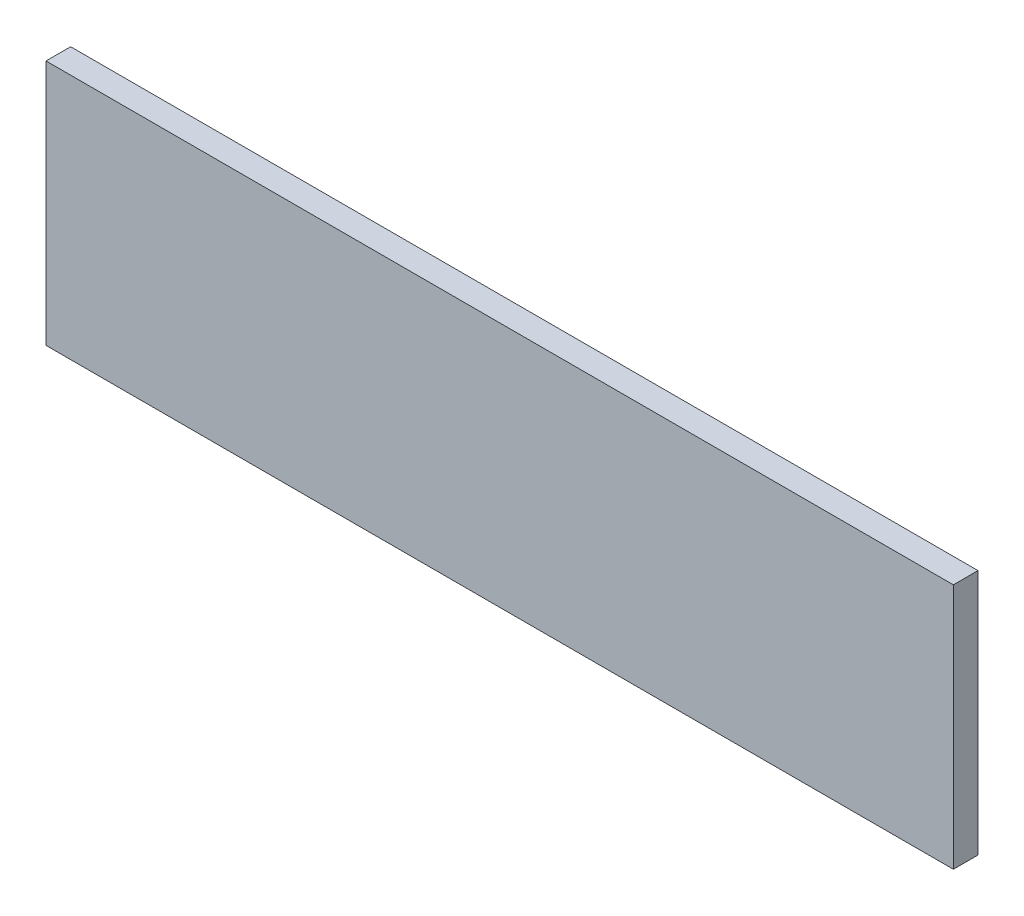
ISO-10303-21;
HEADER;
FILE_DESCRIPTION(('STEP AP214'),'2;1');
FILE_NAME('part.step','',(''),(''),'','','');
FILE_SCHEMA(('AUTOMOTIVE_DESIGN { 1 0 10303 214 1 1 1 1 }'));
ENDSEC;
DATA;
#1=APPLICATION_CONTEXT('core data for automotive mechanical design processes');
#2=APPLICATION_PROTOCOL_DEFINITION('international standard','automotive_design',2000,#1);
#3=PRODUCT_CONTEXT('',#1,'mechanical');
#4=PRODUCT('Part','Part','',(#3));
#5=PRODUCT_RELATED_PRODUCT_CATEGORY('part','',(#4));
#6=PRODUCT_DEFINITION_FORMATION('','',#4);
#7=PRODUCT_DEFINITION_CONTEXT('part definition',#1,'design');
#8=PRODUCT_DEFINITION('design','',#6,#7);
#9=PRODUCT_DEFINITION_SHAPE('','',#8);
#10=(LENGTH_UNIT() NAMED_UNIT(*) SI_UNIT(.MILLI.,.METRE.));
#11=(NAMED_UNIT(*) PLANE_ANGLE_UNIT() SI_UNIT($,.RADIAN.));
#12=(NAMED_UNIT(*) SI_UNIT($,.STERADIAN.) SOLID_ANGLE_UNIT());
#13=UNCERTAINTY_MEASURE_WITH_UNIT(LENGTH_MEASURE(1.E-05),#10,'distance_accuracy_value','');
#14=(GEOMETRIC_REPRESENTATION_CONTEXT(3) GLOBAL_UNCERTAINTY_ASSIGNED_CONTEXT((#13)) GLOBAL_UNIT_ASSIGNED_CONTEXT((#10,
#11,#12)) REPRESENTATION_CONTEXT('',''));
#15=CARTESIAN_POINT('',(0.,0.,0.));
#16=DIRECTION('',(0.,0.,1.));
#17=DIRECTION('',(1.,0.,0.));
#18=AXIS2_PLACEMENT_3D('',#15,#16,#17);
#19=CARTESIAN_POINT('',(110.49,-15.,1.5));
#20=DIRECTION('',(0.,0.,-1.));
#21=DIRECTION('',(-1.,0.,0.));
#22=AXIS2_PLACEMENT_3D('',#19,#20,#21);
#23=PLANE('',#22);
#24=DIRECTION('',(0.,-1.,0.));
#25=VECTOR('',#24,1.);
#26=CARTESIAN_POINT('',(0.,-15.,1.5));
#27=LINE('',#26,#25);
#28=CARTESIAN_POINT('',(0.,15.,1.5));
#29=VERTEX_POINT('',#28);
#30=CARTESIAN_POINT('',(0.,-15.,1.5));
#31=VERTEX_POINT('',#30);
#32=EDGE_CURVE('E95',#29,#31,#27,.T.);
#33=ORIENTED_EDGE('',*,*,#32,.T.);
#34=DIRECTION('',(-1.,0.,0.));
#35=VECTOR('',#34,1.);
#36=CARTESIAN_POINT('',(110.49,-15.,1.5));
#37=LINE('',#36,#35);
#38=CARTESIAN_POINT('',(110.49,-15.,1.5));
#39=VERTEX_POINT('',#38);
#40=EDGE_CURVE('E11',#39,#31,#37,.T.);
#41=ORIENTED_EDGE('',*,*,#40,.F.);
#42=DIRECTION('',(0.,-1.,0.));
#43=VECTOR('',#42,1.);
#44=CARTESIAN_POINT('',(110.49,-15.,1.5));
#45=LINE('',#44,#43);
#46=CARTESIAN_POINT('',(110.49,15.,1.5));
#47=VERTEX_POINT('',#46);
#48=EDGE_CURVE('E83',#47,#39,#45,.T.);
#49=ORIENTED_EDGE('',*,*,#48,.F.);
#50=DIRECTION('',(-1.,0.,0.));
#51=VECTOR('',#50,1.);
#52=CARTESIAN_POINT('',(110.49,15.,1.5));
#53=LINE('',#52,#51);
#54=EDGE_CURVE('E91',#47,#29,#53,.T.);
#55=ORIENTED_EDGE('',*,*,#54,.T.);
#56=EDGE_LOOP('',(#33,#41,#49,#55));
#57=FACE_BOUND('',#56,.T.);
#58=ADVANCED_FACE('F32',(#57),#23,.F.);
#59=CARTESIAN_POINT('',(110.49,-15.,-1.5));
#60=DIRECTION('',(0.,1.,0.));
#61=DIRECTION('',(0.,0.,1.));
#62=AXIS2_PLACEMENT_3D('',#59,#60,#61);
#63=PLANE('',#62);
#64=DIRECTION('',(0.,0.,-1.));
#65=VECTOR('',#64,1.);
#66=CARTESIAN_POINT('',(0.,-15.,-1.5));
#67=LINE('',#66,#65);
#68=CARTESIAN_POINT('',(0.,-15.,-1.5));
#69=VERTEX_POINT('',#68);
#70=EDGE_CURVE('E87',#31,#69,#67,.T.);
#71=ORIENTED_EDGE('',*,*,#70,.T.);
#72=DIRECTION('',(-1.,0.,0.));
#73=VECTOR('',#72,1.);
#74=CARTESIAN_POINT('',(110.49,-15.,-1.5));
#75=LINE('',#74,#73);
#76=CARTESIAN_POINT('',(110.49,-15.,-1.5));
#77=VERTEX_POINT('',#76);
#78=EDGE_CURVE('E40',#77,#69,#75,.T.);
#79=ORIENTED_EDGE('',*,*,#78,.F.);
#80=DIRECTION('',(0.,0.,-1.));
#81=VECTOR('',#80,1.);
#82=CARTESIAN_POINT('',(110.49,-15.,-1.5));
#83=LINE('',#82,#81);
#84=EDGE_CURVE('E78',#39,#77,#83,.T.);
#85=ORIENTED_EDGE('',*,*,#84,.F.);
#86=ORIENTED_EDGE('',*,*,#40,.T.);
#87=EDGE_LOOP('',(#71,#79,#85,#86));
#88=FACE_BOUND('',#87,.T.);
#89=ADVANCED_FACE('F86',(#88),#63,.F.);
#90=CARTESIAN_POINT('',(110.49,-15.,-1.5));
#91=DIRECTION('',(0.,0.,1.));
#92=DIRECTION('',(1.,0.,0.));
#93=AXIS2_PLACEMENT_3D('',#90,#91,#92);
#94=PLANE('',#93);
#95=DIRECTION('',(0.,1.,0.));
#96=VECTOR('',#95,1.);
#97=CARTESIAN_POINT('',(0.,-15.,-1.5));
#98=LINE('',#97,#96);
#99=CARTESIAN_POINT('',(0.,15.,-1.5));
#100=VERTEX_POINT('',#99);
#101=EDGE_CURVE('E65',#69,#100,#98,.T.);
#102=ORIENTED_EDGE('',*,*,#101,.T.);
#103=DIRECTION('',(-1.,0.,0.));
#104=VECTOR('',#103,1.);
#105=CARTESIAN_POINT('',(110.49,15.,-1.5));
#106=LINE('',#105,#104);
#107=CARTESIAN_POINT('',(110.49,15.,-1.5));
#108=VERTEX_POINT('',#107);
#109=EDGE_CURVE('E88',#108,#100,#106,.T.);
#110=ORIENTED_EDGE('',*,*,#109,.F.);
#111=DIRECTION('',(0.,1.,0.));
#112=VECTOR('',#111,1.);
#113=CARTESIAN_POINT('',(110.49,-15.,-1.5));
#114=LINE('',#113,#112);
#115=EDGE_CURVE('E81',#77,#108,#114,.T.);
#116=ORIENTED_EDGE('',*,*,#115,.F.);
#117=ORIENTED_EDGE('',*,*,#78,.T.);
#118=EDGE_LOOP('',(#102,#110,#116,#117));
#119=FACE_BOUND('',#118,.T.);
#120=ADVANCED_FACE('F89',(#119),#94,.F.);
#121=CARTESIAN_POINT('',(110.49,15.,-1.5));
#122=DIRECTION('',(0.,-1.,0.));
#123=DIRECTION('',(0.,0.,-1.));
#124=AXIS2_PLACEMENT_3D('',#121,#122,#123);
#125=PLANE('',#124);
#126=DIRECTION('',(0.,0.,1.));
#127=VECTOR('',#126,1.);
#128=CARTESIAN_POINT('',(0.,15.,-1.5));
#129=LINE('',#128,#127);
#130=EDGE_CURVE('E71',#100,#29,#129,.T.);
#131=ORIENTED_EDGE('',*,*,#130,.T.);
#132=ORIENTED_EDGE('',*,*,#54,.F.);
#133=DIRECTION('',(0.,0.,1.));
#134=VECTOR('',#133,1.);
#135=CARTESIAN_POINT('',(110.49,15.,-1.5));
#136=LINE('',#135,#134);
#137=EDGE_CURVE('E48',#108,#47,#136,.T.);
#138=ORIENTED_EDGE('',*,*,#137,.F.);
#139=ORIENTED_EDGE('',*,*,#109,.T.);
#140=EDGE_LOOP('',(#131,#132,#138,#139));
#141=FACE_BOUND('',#140,.T.);
#142=ADVANCED_FACE('F102',(#141),#125,.F.);
#143=CARTESIAN_POINT('',(110.49,0.,0.));
#144=DIRECTION('',(1.,0.,0.));
#145=DIRECTION('',(0.,0.,-1.));
#146=AXIS2_PLACEMENT_3D('',#143,#144,#145);
#147=PLANE('',#146);
#148=ORIENTED_EDGE('',*,*,#48,.T.);
#149=ORIENTED_EDGE('',*,*,#84,.T.);
#150=ORIENTED_EDGE('',*,*,#115,.T.);
#151=ORIENTED_EDGE('',*,*,#137,.T.);
#152=EDGE_LOOP('',(#148,#149,#150,#151));
#153=FACE_BOUND('',#152,.T.);
#154=ADVANCED_FACE('F79',(#153),#147,.T.);
#155=CARTESIAN_POINT('',(0.,0.,0.));
#156=DIRECTION('',(1.,0.,0.));
#157=DIRECTION('',(0.,0.,-1.));
#158=AXIS2_PLACEMENT_3D('',#155,#156,#157);
#159=PLANE('',#158);
#160=ORIENTED_EDGE('',*,*,#32,.F.);
#161=ORIENTED_EDGE('',*,*,#130,.F.);
#162=ORIENTED_EDGE('',*,*,#101,.F.);
#163=ORIENTED_EDGE('',*,*,#70,.F.);
#164=EDGE_LOOP('',(#160,#161,#162,#163));
#165=FACE_BOUND('',#164,.T.);
#166=ADVANCED_FACE('F105',(#165),#159,.F.);
#167=CLOSED_SHELL('',(#58,#89,#120,#142,#154,#166));
#168=MANIFOLD_SOLID_BREP('B2',#167);
#169=ADVANCED_BREP_SHAPE_REPRESENTATION('',(#18,#168),#14);
#170=SHAPE_DEFINITION_REPRESENTATION(#9,#169);
ENDSEC;
END-ISO-10303-21;
